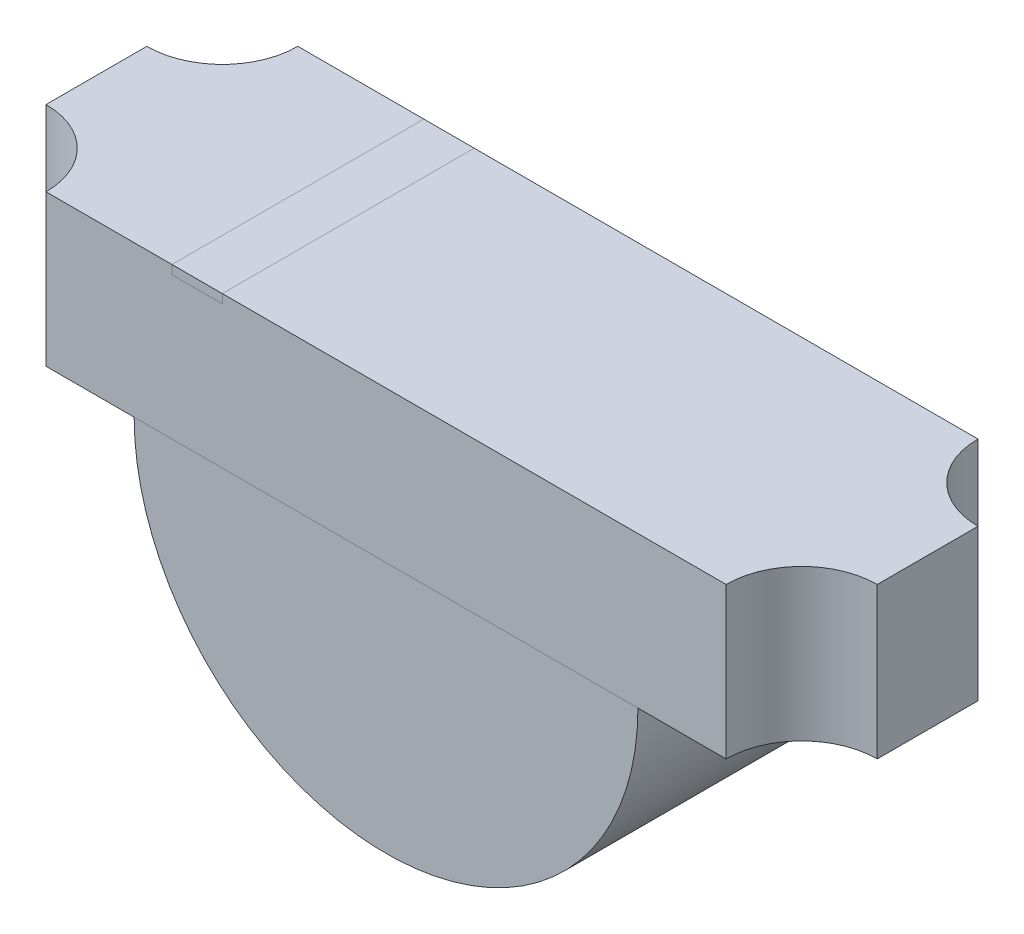
ISO-10303-21;
HEADER;
FILE_DESCRIPTION(('STEP AP214'),'2;1');
FILE_NAME('part.step','',(''),(''),'','','');
FILE_SCHEMA(('AUTOMOTIVE_DESIGN { 1 0 10303 214 1 1 1 1 }'));
ENDSEC;
DATA;
#1=APPLICATION_CONTEXT('core data for automotive mechanical design processes');
#2=APPLICATION_PROTOCOL_DEFINITION('international standard','automotive_design',2000,#1);
#3=PRODUCT_CONTEXT('',#1,'mechanical');
#4=PRODUCT('Part','Part','',(#3));
#5=PRODUCT_RELATED_PRODUCT_CATEGORY('part','',(#4));
#6=PRODUCT_DEFINITION_FORMATION('','',#4);
#7=PRODUCT_DEFINITION_CONTEXT('part definition',#1,'design');
#8=PRODUCT_DEFINITION('design','',#6,#7);
#9=PRODUCT_DEFINITION_SHAPE('','',#8);
#10=(LENGTH_UNIT() NAMED_UNIT(*) SI_UNIT(.MILLI.,.METRE.));
#11=(NAMED_UNIT(*) PLANE_ANGLE_UNIT() SI_UNIT($,.RADIAN.));
#12=(NAMED_UNIT(*) SI_UNIT($,.STERADIAN.) SOLID_ANGLE_UNIT());
#13=UNCERTAINTY_MEASURE_WITH_UNIT(LENGTH_MEASURE(1.E-05),#10,'distance_accuracy_value','');
#14=(GEOMETRIC_REPRESENTATION_CONTEXT(3) GLOBAL_UNCERTAINTY_ASSIGNED_CONTEXT((#13)) GLOBAL_UNIT_ASSIGNED_CONTEXT((#10,
#11,#12)) REPRESENTATION_CONTEXT('',''));
#15=CARTESIAN_POINT('',(0.,0.,0.));
#16=DIRECTION('',(0.,0.,1.));
#17=DIRECTION('',(1.,0.,0.));
#18=AXIS2_PLACEMENT_3D('',#15,#16,#17);
#19=CARTESIAN_POINT('',(-0.85,0.2825,0.5));
#20=DIRECTION('',(1.,0.,0.));
#21=DIRECTION('',(0.,0.,-1.));
#22=AXIS2_PLACEMENT_3D('',#19,#20,#21);
#23=PLANE('',#22);
#24=DIRECTION('',(0.,1.,0.));
#25=VECTOR('',#24,1.);
#26=CARTESIAN_POINT('',(-0.85,0.05,0.));
#27=LINE('',#26,#25);
#28=CARTESIAN_POINT('',(-0.85,0.265,0.));
#29=VERTEX_POINT('',#28);
#30=CARTESIAN_POINT('',(-0.85,0.3,0.));
#31=VERTEX_POINT('',#30);
#32=EDGE_CURVE('P0_E191',#29,#31,#27,.T.);
#33=ORIENTED_EDGE('',*,*,#32,.T.);
#34=DIRECTION('',(0.,0.,-1.));
#35=VECTOR('',#34,1.);
#36=CARTESIAN_POINT('',(-0.85,0.3,0.5));
#37=LINE('',#36,#35);
#38=CARTESIAN_POINT('',(-0.85,0.3,1.));
#39=VERTEX_POINT('',#38);
#40=EDGE_CURVE('P0_E97',#31,#39,#37,.F.);
#41=ORIENTED_EDGE('',*,*,#40,.T.);
#42=DIRECTION('',(0.,1.,0.));
#43=VECTOR('',#42,1.);
#44=CARTESIAN_POINT('',(-0.85,0.05,1.));
#45=LINE('',#44,#43);
#46=CARTESIAN_POINT('',(-0.85,0.265,1.));
#47=VERTEX_POINT('',#46);
#48=EDGE_CURVE('P0_E130',#47,#39,#45,.T.);
#49=ORIENTED_EDGE('',*,*,#48,.F.);
#50=DIRECTION('',(0.,0.,-1.));
#51=VECTOR('',#50,1.);
#52=CARTESIAN_POINT('',(-0.85,0.265,0.5));
#53=LINE('',#52,#51);
#54=EDGE_CURVE('P0_E150',#47,#29,#53,.T.);
#55=ORIENTED_EDGE('',*,*,#54,.T.);
#56=EDGE_LOOP('',(#33,#41,#49,#55));
#57=FACE_BOUND('',#56,.T.);
#58=ADVANCED_FACE('P0_F17',(#57),#23,.T.);
#59=CARTESIAN_POINT('',(-0.05,0.3,0.5));
#60=DIRECTION('',(0.,-1.,0.));
#61=DIRECTION('',(0.,0.,-1.));
#62=AXIS2_PLACEMENT_3D('',#59,#60,#61);
#63=PLANE('',#62);
#64=DIRECTION('',(1.,0.,0.));
#65=VECTOR('',#64,1.);
#66=CARTESIAN_POINT('',(0.,0.3,0.));
#67=LINE('',#66,#65);
#68=CARTESIAN_POINT('',(-1.34999999999999,0.3,1.13403910900508E-12));
#69=VERTEX_POINT('',#68);
#70=EDGE_CURVE('P0_E107',#31,#69,#67,.F.);
#71=ORIENTED_EDGE('',*,*,#70,.T.);
#72=CARTESIAN_POINT('',(-1.65,0.3,0.));
#73=DIRECTION('',(0.,1.,0.));
#74=DIRECTION('',(0.,0.,1.));
#75=AXIS2_PLACEMENT_3D('',#72,#73,#74);
#76=CIRCLE('',#75,0.30000000000001);
#77=CARTESIAN_POINT('',(-1.65,0.3,0.300000000000004));
#78=VERTEX_POINT('',#77);
#79=EDGE_CURVE('P0_E138',#69,#78,#76,.F.);
#80=ORIENTED_EDGE('',*,*,#79,.T.);
#81=DIRECTION('',(0.,0.,-1.));
#82=VECTOR('',#81,1.);
#83=CARTESIAN_POINT('',(-1.65,0.3,0.5));
#84=LINE('',#83,#82);
#85=CARTESIAN_POINT('',(-1.65,0.3,0.7));
#86=VERTEX_POINT('',#85);
#87=EDGE_CURVE('P0_E135',#78,#86,#84,.F.);
#88=ORIENTED_EDGE('',*,*,#87,.T.);
#89=CARTESIAN_POINT('',(-1.65,0.3,1.));
#90=DIRECTION('',(0.,1.,0.));
#91=DIRECTION('',(-1.,0.,0.));
#92=AXIS2_PLACEMENT_3D('',#89,#90,#91);
#93=CIRCLE('',#92,0.3);
#94=CARTESIAN_POINT('',(-1.35,0.3,1.));
#95=VERTEX_POINT('',#94);
#96=EDGE_CURVE('P0_E131',#86,#95,#93,.F.);
#97=ORIENTED_EDGE('',*,*,#96,.T.);
#98=DIRECTION('',(1.,0.,0.));
#99=VECTOR('',#98,1.);
#100=CARTESIAN_POINT('',(0.,0.3,1.));
#101=LINE('',#100,#99);
#102=EDGE_CURVE('P0_E126',#39,#95,#101,.F.);
#103=ORIENTED_EDGE('',*,*,#102,.F.);
#104=ORIENTED_EDGE('',*,*,#40,.F.);
#105=EDGE_LOOP('',(#71,#80,#88,#97,#103,#104));
#106=FACE_BOUND('',#105,.T.);
#107=ADVANCED_FACE('P0_F341',(#106),#63,.F.);
#108=CARTESIAN_POINT('',(0.05,0.3,0.5));
#109=DIRECTION('',(0.,-1.,0.));
#110=DIRECTION('',(0.,0.,-1.));
#111=AXIS2_PLACEMENT_3D('',#108,#109,#110);
#112=PLANE('',#111);
#113=DIRECTION('',(1.,0.,0.));
#114=VECTOR('',#113,1.);
#115=CARTESIAN_POINT('',(0.,0.3,1.));
#116=LINE('',#115,#114);
#117=CARTESIAN_POINT('',(1.34999999999999,0.3,0.999999999998866));
#118=VERTEX_POINT('',#117);
#119=CARTESIAN_POINT('',(-0.65,0.3,1.));
#120=VERTEX_POINT('',#119);
#121=EDGE_CURVE('P0_E125',#118,#120,#116,.F.);
#122=ORIENTED_EDGE('',*,*,#121,.F.);
#123=CARTESIAN_POINT('',(1.65,0.3,1.));
#124=DIRECTION('',(0.,1.,0.));
#125=DIRECTION('',(0.,0.,1.));
#126=AXIS2_PLACEMENT_3D('',#123,#124,#125);
#127=CIRCLE('',#126,0.300000000000011);
#128=CARTESIAN_POINT('',(1.65,0.3,0.699999999999995));
#129=VERTEX_POINT('',#128);
#130=EDGE_CURVE('P0_E152',#129,#118,#127,.T.);
#131=ORIENTED_EDGE('',*,*,#130,.F.);
#132=DIRECTION('',(0.,0.,-1.));
#133=VECTOR('',#132,1.);
#134=CARTESIAN_POINT('',(1.65,0.3,0.5));
#135=LINE('',#134,#133);
#136=CARTESIAN_POINT('',(1.65,0.3,0.299999999999999));
#137=VERTEX_POINT('',#136);
#138=EDGE_CURVE('P0_E95',#137,#129,#135,.F.);
#139=ORIENTED_EDGE('',*,*,#138,.F.);
#140=CARTESIAN_POINT('',(1.65,0.3,0.));
#141=DIRECTION('',(0.,1.,0.));
#142=DIRECTION('',(-1.,0.,0.));
#143=AXIS2_PLACEMENT_3D('',#140,#141,#142);
#144=CIRCLE('',#143,0.3);
#145=CARTESIAN_POINT('',(1.35,0.3,0.));
#146=VERTEX_POINT('',#145);
#147=EDGE_CURVE('P0_E21',#146,#137,#144,.T.);
#148=ORIENTED_EDGE('',*,*,#147,.F.);
#149=DIRECTION('',(1.,0.,0.));
#150=VECTOR('',#149,1.);
#151=CARTESIAN_POINT('',(0.,0.3,0.));
#152=LINE('',#151,#150);
#153=CARTESIAN_POINT('',(-0.65,0.3,0.));
#154=VERTEX_POINT('',#153);
#155=EDGE_CURVE('P0_E93',#146,#154,#152,.F.);
#156=ORIENTED_EDGE('',*,*,#155,.T.);
#157=DIRECTION('',(0.,0.,1.));
#158=VECTOR('',#157,1.);
#159=CARTESIAN_POINT('',(-0.65,0.3,0.5));
#160=LINE('',#159,#158);
#161=EDGE_CURVE('P0_E153',#120,#154,#160,.F.);
#162=ORIENTED_EDGE('',*,*,#161,.F.);
#163=EDGE_LOOP('',(#122,#131,#139,#148,#156,#162));
#164=FACE_BOUND('',#163,.T.);
#165=ADVANCED_FACE('P0_F90',(#164),#112,.F.);
#166=CARTESIAN_POINT('',(-0.65,0.2825,0.5));
#167=DIRECTION('',(-1.,0.,0.));
#168=DIRECTION('',(0.,0.,1.));
#169=AXIS2_PLACEMENT_3D('',#166,#167,#168);
#170=PLANE('',#169);
#171=DIRECTION('',(0.,1.,0.));
#172=VECTOR('',#171,1.);
#173=CARTESIAN_POINT('',(-0.65,0.05,1.));
#174=LINE('',#173,#172);
#175=CARTESIAN_POINT('',(-0.65,0.265,1.));
#176=VERTEX_POINT('',#175);
#177=EDGE_CURVE('P0_E144',#120,#176,#174,.F.);
#178=ORIENTED_EDGE('',*,*,#177,.F.);
#179=ORIENTED_EDGE('',*,*,#161,.T.);
#180=DIRECTION('',(0.,1.,0.));
#181=VECTOR('',#180,1.);
#182=CARTESIAN_POINT('',(-0.65,0.05,0.));
#183=LINE('',#182,#181);
#184=CARTESIAN_POINT('',(-0.65,0.265,0.));
#185=VERTEX_POINT('',#184);
#186=EDGE_CURVE('P0_E106',#154,#185,#183,.F.);
#187=ORIENTED_EDGE('',*,*,#186,.T.);
#188=DIRECTION('',(0.,0.,-1.));
#189=VECTOR('',#188,1.);
#190=CARTESIAN_POINT('',(-0.65,0.265,0.5));
#191=LINE('',#190,#189);
#192=EDGE_CURVE('P0_E147',#185,#176,#191,.F.);
#193=ORIENTED_EDGE('',*,*,#192,.T.);
#194=EDGE_LOOP('',(#178,#179,#187,#193));
#195=FACE_BOUND('',#194,.T.);
#196=ADVANCED_FACE('P0_F322',(#195),#170,.T.);
#197=CARTESIAN_POINT('',(-0.75,0.265,0.5));
#198=DIRECTION('',(0.,-1.,0.));
#199=DIRECTION('',(0.,0.,-1.));
#200=AXIS2_PLACEMENT_3D('',#197,#198,#199);
#201=PLANE('',#200);
#202=ORIENTED_EDGE('',*,*,#192,.F.);
#203=DIRECTION('',(1.,0.,0.));
#204=VECTOR('',#203,1.);
#205=CARTESIAN_POINT('',(0.,0.265,0.));
#206=LINE('',#205,#204);
#207=EDGE_CURVE('P0_E188',#185,#29,#206,.F.);
#208=ORIENTED_EDGE('',*,*,#207,.T.);
#209=ORIENTED_EDGE('',*,*,#54,.F.);
#210=DIRECTION('',(1.,0.,0.));
#211=VECTOR('',#210,1.);
#212=CARTESIAN_POINT('',(0.,0.265,1.));
#213=LINE('',#212,#211);
#214=EDGE_CURVE('P0_E122',#176,#47,#213,.F.);
#215=ORIENTED_EDGE('',*,*,#214,.F.);
#216=EDGE_LOOP('',(#202,#208,#209,#215));
#217=FACE_BOUND('',#216,.T.);
#218=ADVANCED_FACE('P0_F313',(#217),#201,.F.);
#219=CARTESIAN_POINT('',(0.,0.05,0.));
#220=DIRECTION('',(0.,0.,1.));
#221=DIRECTION('',(1.,0.,0.));
#222=AXIS2_PLACEMENT_3D('',#219,#220,#221);
#223=PLANE('',#222);
#224=ORIENTED_EDGE('',*,*,#207,.F.);
#225=ORIENTED_EDGE('',*,*,#186,.F.);
#226=ORIENTED_EDGE('',*,*,#155,.F.);
#227=DIRECTION('',(0.,1.,0.));
#228=VECTOR('',#227,1.);
#229=CARTESIAN_POINT('',(1.35,0.374976204826,0.));
#230=LINE('',#229,#228);
#231=CARTESIAN_POINT('',(1.35,-0.3,0.));
#232=VERTEX_POINT('',#231);
#233=EDGE_CURVE('P0_E104',#146,#232,#230,.F.);
#234=ORIENTED_EDGE('',*,*,#233,.T.);
#235=DIRECTION('',(1.,0.,0.));
#236=VECTOR('',#235,1.);
#237=CARTESIAN_POINT('',(0.,-0.3,0.));
#238=LINE('',#237,#236);
#239=CARTESIAN_POINT('',(-1.34999999999999,-0.3,1.13403910900508E-12));
#240=VERTEX_POINT('',#239);
#241=EDGE_CURVE('P0_E112',#232,#240,#238,.F.);
#242=ORIENTED_EDGE('',*,*,#241,.T.);
#243=DIRECTION('',(0.,1.,0.));
#244=VECTOR('',#243,1.);
#245=CARTESIAN_POINT('',(-1.35,0.,2.26807821801017E-12));
#246=LINE('',#245,#244);
#247=EDGE_CURVE('P0_E136',#240,#69,#246,.T.);
#248=ORIENTED_EDGE('',*,*,#247,.T.);
#249=ORIENTED_EDGE('',*,*,#70,.F.);
#250=ORIENTED_EDGE('',*,*,#32,.F.);
#251=EDGE_LOOP('',(#224,#225,#226,#234,#242,#248,#249,#250));
#252=FACE_BOUND('',#251,.T.);
#253=ADVANCED_FACE('P0_F102',(#252),#223,.F.);
#254=CARTESIAN_POINT('',(-1.65,-0.3,0.));
#255=DIRECTION('',(0.,1.,0.));
#256=DIRECTION('',(0.,0.,1.));
#257=AXIS2_PLACEMENT_3D('',#254,#255,#256);
#258=CYLINDRICAL_SURFACE('',#257,0.30000000000001);
#259=CARTESIAN_POINT('',(-1.65,-0.3,0.));
#260=DIRECTION('',(0.,1.,0.));
#261=DIRECTION('',(0.,0.,1.));
#262=AXIS2_PLACEMENT_3D('',#259,#260,#261);
#263=CIRCLE('',#262,0.30000000000001);
#264=CARTESIAN_POINT('',(-1.65,-0.3,0.300000000000004));
#265=VERTEX_POINT('',#264);
#266=EDGE_CURVE('P0_E208',#240,#265,#263,.F.);
#267=ORIENTED_EDGE('',*,*,#266,.T.);
#268=DIRECTION('',(0.,1.,0.));
#269=VECTOR('',#268,1.);
#270=CARTESIAN_POINT('',(-1.65,-0.05,0.3));
#271=LINE('',#270,#269);
#272=EDGE_CURVE('P0_E132',#265,#78,#271,.T.);
#273=ORIENTED_EDGE('',*,*,#272,.T.);
#274=ORIENTED_EDGE('',*,*,#79,.F.);
#275=ORIENTED_EDGE('',*,*,#247,.F.);
#276=EDGE_LOOP('',(#267,#273,#274,#275));
#277=FACE_BOUND('',#276,.T.);
#278=ADVANCED_FACE('P0_F234',(#277),#258,.F.);
#279=CARTESIAN_POINT('',(-1.65,-0.05,0.5));
#280=DIRECTION('',(1.,0.,0.));
#281=DIRECTION('',(0.,0.,-1.));
#282=AXIS2_PLACEMENT_3D('',#279,#280,#281);
#283=PLANE('',#282);
#284=DIRECTION('',(0.,0.,1.));
#285=VECTOR('',#284,1.);
#286=CARTESIAN_POINT('',(-1.65,-0.3,0.5));
#287=LINE('',#286,#285);
#288=CARTESIAN_POINT('',(-1.65,-0.3,0.7));
#289=VERTEX_POINT('',#288);
#290=EDGE_CURVE('P0_E207',#265,#289,#287,.T.);
#291=ORIENTED_EDGE('',*,*,#290,.T.);
#292=DIRECTION('',(0.,1.,0.));
#293=VECTOR('',#292,1.);
#294=CARTESIAN_POINT('',(-1.65,0.374976204826,0.7));
#295=LINE('',#294,#293);
#296=EDGE_CURVE('P0_E127',#289,#86,#295,.T.);
#297=ORIENTED_EDGE('',*,*,#296,.T.);
#298=ORIENTED_EDGE('',*,*,#87,.F.);
#299=ORIENTED_EDGE('',*,*,#272,.F.);
#300=EDGE_LOOP('',(#291,#297,#298,#299));
#301=FACE_BOUND('',#300,.T.);
#302=ADVANCED_FACE('P0_F229',(#301),#283,.F.);
#303=CARTESIAN_POINT('',(-1.65,0.374976204826,1.));
#304=DIRECTION('',(0.,1.,0.));
#305=DIRECTION('',(-1.,0.,0.));
#306=AXIS2_PLACEMENT_3D('',#303,#304,#305);
#307=CYLINDRICAL_SURFACE('',#306,0.3);
#308=CARTESIAN_POINT('',(-1.65,-0.3,1.));
#309=DIRECTION('',(0.,1.,0.));
#310=DIRECTION('',(-1.,0.,0.));
#311=AXIS2_PLACEMENT_3D('',#308,#309,#310);
#312=CIRCLE('',#311,0.3);
#313=CARTESIAN_POINT('',(-1.35,-0.3,1.));
#314=VERTEX_POINT('',#313);
#315=EDGE_CURVE('P0_E204',#289,#314,#312,.F.);
#316=ORIENTED_EDGE('',*,*,#315,.T.);
#317=DIRECTION('',(0.,1.,0.));
#318=VECTOR('',#317,1.);
#319=CARTESIAN_POINT('',(-1.35,0.05,1.));
#320=LINE('',#319,#318);
#321=EDGE_CURVE('P0_E123',#95,#314,#320,.F.);
#322=ORIENTED_EDGE('',*,*,#321,.F.);
#323=ORIENTED_EDGE('',*,*,#96,.F.);
#324=ORIENTED_EDGE('',*,*,#296,.F.);
#325=EDGE_LOOP('',(#316,#322,#323,#324));
#326=FACE_BOUND('',#325,.T.);
#327=ADVANCED_FACE('P0_F281',(#326),#307,.F.);
#328=CARTESIAN_POINT('',(0.,0.05,1.));
#329=DIRECTION('',(0.,0.,1.));
#330=DIRECTION('',(1.,0.,0.));
#331=AXIS2_PLACEMENT_3D('',#328,#329,#330);
#332=PLANE('',#331);
#333=ORIENTED_EDGE('',*,*,#177,.T.);
#334=ORIENTED_EDGE('',*,*,#214,.T.);
#335=ORIENTED_EDGE('',*,*,#48,.T.);
#336=ORIENTED_EDGE('',*,*,#102,.T.);
#337=ORIENTED_EDGE('',*,*,#321,.T.);
#338=DIRECTION('',(1.,0.,0.));
#339=VECTOR('',#338,1.);
#340=CARTESIAN_POINT('',(0.,-0.3,1.));
#341=LINE('',#340,#339);
#342=CARTESIAN_POINT('',(1.34999999999999,-0.3,0.999999999998866));
#343=VERTEX_POINT('',#342);
#344=EDGE_CURVE('P0_E203',#314,#343,#341,.T.);
#345=ORIENTED_EDGE('',*,*,#344,.T.);
#346=DIRECTION('',(0.,1.,0.));
#347=VECTOR('',#346,1.);
#348=CARTESIAN_POINT('',(1.35,0.,0.999999999997732));
#349=LINE('',#348,#347);
#350=EDGE_CURVE('P0_E115',#343,#118,#349,.T.);
#351=ORIENTED_EDGE('',*,*,#350,.T.);
#352=ORIENTED_EDGE('',*,*,#121,.T.);
#353=EDGE_LOOP('',(#333,#334,#335,#336,#337,#345,#351,#352));
#354=FACE_BOUND('',#353,.T.);
#355=ADVANCED_FACE('P0_F219',(#354),#332,.T.);
#356=CARTESIAN_POINT('',(1.65,-0.3,1.));
#357=DIRECTION('',(0.,1.,0.));
#358=DIRECTION('',(0.,0.,1.));
#359=AXIS2_PLACEMENT_3D('',#356,#357,#358);
#360=CYLINDRICAL_SURFACE('',#359,0.300000000000011);
#361=CARTESIAN_POINT('',(1.65,-0.3,1.));
#362=DIRECTION('',(0.,1.,0.));
#363=DIRECTION('',(0.,0.,1.));
#364=AXIS2_PLACEMENT_3D('',#361,#362,#363);
#365=CIRCLE('',#364,0.300000000000011);
#366=CARTESIAN_POINT('',(1.65,-0.3,0.699999999999995));
#367=VERTEX_POINT('',#366);
#368=EDGE_CURVE('P0_E200',#343,#367,#365,.F.);
#369=ORIENTED_EDGE('',*,*,#368,.T.);
#370=DIRECTION('',(0.,1.,0.));
#371=VECTOR('',#370,1.);
#372=CARTESIAN_POINT('',(1.65,-0.05,0.7));
#373=LINE('',#372,#371);
#374=EDGE_CURVE('P0_E110',#367,#129,#373,.T.);
#375=ORIENTED_EDGE('',*,*,#374,.T.);
#376=ORIENTED_EDGE('',*,*,#130,.T.);
#377=ORIENTED_EDGE('',*,*,#350,.F.);
#378=EDGE_LOOP('',(#369,#375,#376,#377));
#379=FACE_BOUND('',#378,.T.);
#380=ADVANCED_FACE('P0_F19',(#379),#360,.F.);
#381=CARTESIAN_POINT('',(1.65,-0.05,0.5));
#382=DIRECTION('',(-1.,0.,0.));
#383=DIRECTION('',(0.,0.,1.));
#384=AXIS2_PLACEMENT_3D('',#381,#382,#383);
#385=PLANE('',#384);
#386=DIRECTION('',(0.,0.,1.));
#387=VECTOR('',#386,1.);
#388=CARTESIAN_POINT('',(1.65,-0.3,0.5));
#389=LINE('',#388,#387);
#390=CARTESIAN_POINT('',(1.65,-0.3,0.299999999999999));
#391=VERTEX_POINT('',#390);
#392=EDGE_CURVE('P0_E27',#367,#391,#389,.F.);
#393=ORIENTED_EDGE('',*,*,#392,.T.);
#394=DIRECTION('',(0.,1.,0.));
#395=VECTOR('',#394,1.);
#396=CARTESIAN_POINT('',(1.65,0.374976204826,0.299999999999999));
#397=LINE('',#396,#395);
#398=EDGE_CURVE('P0_E35',#391,#137,#397,.T.);
#399=ORIENTED_EDGE('',*,*,#398,.T.);
#400=ORIENTED_EDGE('',*,*,#138,.T.);
#401=ORIENTED_EDGE('',*,*,#374,.F.);
#402=EDGE_LOOP('',(#393,#399,#400,#401));
#403=FACE_BOUND('',#402,.T.);
#404=ADVANCED_FACE('P0_F239',(#403),#385,.F.);
#405=CARTESIAN_POINT('',(1.65,0.374976204826,0.));
#406=DIRECTION('',(0.,1.,0.));
#407=DIRECTION('',(-1.,0.,0.));
#408=AXIS2_PLACEMENT_3D('',#405,#406,#407);
#409=CYLINDRICAL_SURFACE('',#408,0.3);
#410=CARTESIAN_POINT('',(1.65,-0.3,0.));
#411=DIRECTION('',(0.,1.,0.));
#412=DIRECTION('',(-1.,0.,0.));
#413=AXIS2_PLACEMENT_3D('',#410,#411,#412);
#414=CIRCLE('',#413,0.3);
#415=EDGE_CURVE('P0_E11',#391,#232,#414,.F.);
#416=ORIENTED_EDGE('',*,*,#415,.T.);
#417=ORIENTED_EDGE('',*,*,#233,.F.);
#418=ORIENTED_EDGE('',*,*,#147,.T.);
#419=ORIENTED_EDGE('',*,*,#398,.F.);
#420=EDGE_LOOP('',(#416,#417,#418,#419));
#421=FACE_BOUND('',#420,.T.);
#422=ADVANCED_FACE('P0_F109',(#421),#409,.F.);
#423=CARTESIAN_POINT('',(0.,-0.3,0.5));
#424=DIRECTION('',(0.,1.,0.));
#425=DIRECTION('',(0.,0.,1.));
#426=AXIS2_PLACEMENT_3D('',#423,#424,#425);
#427=PLANE('',#426);
#428=ORIENTED_EDGE('',*,*,#392,.F.);
#429=ORIENTED_EDGE('',*,*,#368,.F.);
#430=ORIENTED_EDGE('',*,*,#344,.F.);
#431=ORIENTED_EDGE('',*,*,#315,.F.);
#432=ORIENTED_EDGE('',*,*,#290,.F.);
#433=ORIENTED_EDGE('',*,*,#266,.F.);
#434=ORIENTED_EDGE('',*,*,#241,.F.);
#435=ORIENTED_EDGE('',*,*,#415,.F.);
#436=EDGE_LOOP('',(#428,#429,#430,#431,#432,#433,#434,#435));
#437=FACE_BOUND('',#436,.T.);
#438=ADVANCED_FACE('P0_F232',(#437),#427,.F.);
#439=CLOSED_SHELL('',(#58,#107,#165,#196,#218,#253,#278,#302,#327,#355,#380,#404,#422,#438));
#440=MANIFOLD_SOLID_BREP('P0_B1',#439);
#441=CARTESIAN_POINT('',(-0.75,0.3,0.5));
#442=DIRECTION('',(0.,-1.,0.));
#443=DIRECTION('',(0.,0.,-1.));
#444=AXIS2_PLACEMENT_3D('',#441,#442,#443);
#445=PLANE('',#444);
#446=DIRECTION('',(0.,0.,1.));
#447=VECTOR('',#446,1.);
#448=CARTESIAN_POINT('',(-0.65,0.3,0.5));
#449=LINE('',#448,#447);
#450=CARTESIAN_POINT('',(-0.65,0.3,1.));
#451=VERTEX_POINT('',#450);
#452=CARTESIAN_POINT('',(-0.65,0.3,0.));
#453=VERTEX_POINT('',#452);
#454=EDGE_CURVE('P1_E80',#451,#453,#449,.F.);
#455=ORIENTED_EDGE('',*,*,#454,.T.);
#456=DIRECTION('',(1.,0.,0.));
#457=VECTOR('',#456,1.);
#458=CARTESIAN_POINT('',(-0.75,0.3,0.));
#459=LINE('',#458,#457);
#460=CARTESIAN_POINT('',(-0.85,0.3,0.));
#461=VERTEX_POINT('',#460);
#462=EDGE_CURVE('P1_E55',#453,#461,#459,.F.);
#463=ORIENTED_EDGE('',*,*,#462,.T.);
#464=DIRECTION('',(0.,0.,-1.));
#465=VECTOR('',#464,1.);
#466=CARTESIAN_POINT('',(-0.85,0.3,0.5));
#467=LINE('',#466,#465);
#468=CARTESIAN_POINT('',(-0.85,0.3,1.));
#469=VERTEX_POINT('',#468);
#470=EDGE_CURVE('P1_E57',#461,#469,#467,.F.);
#471=ORIENTED_EDGE('',*,*,#470,.T.);
#472=DIRECTION('',(-1.,0.,0.));
#473=VECTOR('',#472,1.);
#474=CARTESIAN_POINT('',(-0.75,0.3,1.));
#475=LINE('',#474,#473);
#476=EDGE_CURVE('P1_E20',#469,#451,#475,.F.);
#477=ORIENTED_EDGE('',*,*,#476,.T.);
#478=EDGE_LOOP('',(#455,#463,#471,#477));
#479=FACE_BOUND('',#478,.T.);
#480=ADVANCED_FACE('P1_F17',(#479),#445,.F.);
#481=CARTESIAN_POINT('',(-0.75,0.2825,1.));
#482=DIRECTION('',(0.,0.,-1.));
#483=DIRECTION('',(-1.,0.,0.));
#484=AXIS2_PLACEMENT_3D('',#481,#482,#483);
#485=PLANE('',#484);
#486=ORIENTED_EDGE('',*,*,#476,.F.);
#487=DIRECTION('',(0.,1.,0.));
#488=VECTOR('',#487,1.);
#489=CARTESIAN_POINT('',(-0.85,0.2825,1.));
#490=LINE('',#489,#488);
#491=CARTESIAN_POINT('',(-0.85,0.265,1.));
#492=VERTEX_POINT('',#491);
#493=EDGE_CURVE('P1_E63',#469,#492,#490,.F.);
#494=ORIENTED_EDGE('',*,*,#493,.T.);
#495=DIRECTION('',(1.,0.,0.));
#496=VECTOR('',#495,1.);
#497=CARTESIAN_POINT('',(-0.75,0.265,1.));
#498=LINE('',#497,#496);
#499=CARTESIAN_POINT('',(-0.65,0.265,1.));
#500=VERTEX_POINT('',#499);
#501=EDGE_CURVE('P1_E83',#500,#492,#498,.F.);
#502=ORIENTED_EDGE('',*,*,#501,.F.);
#503=DIRECTION('',(0.,1.,0.));
#504=VECTOR('',#503,1.);
#505=CARTESIAN_POINT('',(-0.65,0.2825,1.));
#506=LINE('',#505,#504);
#507=EDGE_CURVE('P1_E68',#500,#451,#506,.T.);
#508=ORIENTED_EDGE('',*,*,#507,.T.);
#509=EDGE_LOOP('',(#486,#494,#502,#508));
#510=FACE_BOUND('',#509,.T.);
#511=ADVANCED_FACE('P1_F65',(#510),#485,.F.);
#512=CARTESIAN_POINT('',(-0.85,0.2825,0.5));
#513=DIRECTION('',(1.,0.,0.));
#514=DIRECTION('',(0.,0.,-1.));
#515=AXIS2_PLACEMENT_3D('',#512,#513,#514);
#516=PLANE('',#515);
#517=ORIENTED_EDGE('',*,*,#470,.F.);
#518=DIRECTION('',(0.,1.,0.));
#519=VECTOR('',#518,1.);
#520=CARTESIAN_POINT('',(-0.85,0.2825,0.));
#521=LINE('',#520,#519);
#522=CARTESIAN_POINT('',(-0.85,0.265,0.));
#523=VERTEX_POINT('',#522);
#524=EDGE_CURVE('P1_E75',#461,#523,#521,.F.);
#525=ORIENTED_EDGE('',*,*,#524,.T.);
#526=DIRECTION('',(0.,0.,-1.));
#527=VECTOR('',#526,1.);
#528=CARTESIAN_POINT('',(-0.85,0.265,0.5));
#529=LINE('',#528,#527);
#530=EDGE_CURVE('P1_E72',#492,#523,#529,.T.);
#531=ORIENTED_EDGE('',*,*,#530,.F.);
#532=ORIENTED_EDGE('',*,*,#493,.F.);
#533=EDGE_LOOP('',(#517,#525,#531,#532));
#534=FACE_BOUND('',#533,.T.);
#535=ADVANCED_FACE('P1_F70',(#534),#516,.F.);
#536=CARTESIAN_POINT('',(-0.75,0.2825,0.));
#537=DIRECTION('',(0.,0.,1.));
#538=DIRECTION('',(1.,0.,0.));
#539=AXIS2_PLACEMENT_3D('',#536,#537,#538);
#540=PLANE('',#539);
#541=ORIENTED_EDGE('',*,*,#462,.F.);
#542=DIRECTION('',(0.,1.,0.));
#543=VECTOR('',#542,1.);
#544=CARTESIAN_POINT('',(-0.65,0.2825,0.));
#545=LINE('',#544,#543);
#546=CARTESIAN_POINT('',(-0.65,0.265,0.));
#547=VERTEX_POINT('',#546);
#548=EDGE_CURVE('P1_E35',#453,#547,#545,.F.);
#549=ORIENTED_EDGE('',*,*,#548,.T.);
#550=DIRECTION('',(1.,0.,0.));
#551=VECTOR('',#550,1.);
#552=CARTESIAN_POINT('',(-0.75,0.265,0.));
#553=LINE('',#552,#551);
#554=EDGE_CURVE('P1_E26',#523,#547,#553,.T.);
#555=ORIENTED_EDGE('',*,*,#554,.F.);
#556=ORIENTED_EDGE('',*,*,#524,.F.);
#557=EDGE_LOOP('',(#541,#549,#555,#556));
#558=FACE_BOUND('',#557,.T.);
#559=ADVANCED_FACE('P1_F89',(#558),#540,.F.);
#560=CARTESIAN_POINT('',(-0.65,0.2825,0.5));
#561=DIRECTION('',(-1.,0.,0.));
#562=DIRECTION('',(0.,0.,1.));
#563=AXIS2_PLACEMENT_3D('',#560,#561,#562);
#564=PLANE('',#563);
#565=ORIENTED_EDGE('',*,*,#454,.F.);
#566=ORIENTED_EDGE('',*,*,#507,.F.);
#567=DIRECTION('',(0.,0.,-1.));
#568=VECTOR('',#567,1.);
#569=CARTESIAN_POINT('',(-0.65,0.265,0.5));
#570=LINE('',#569,#568);
#571=EDGE_CURVE('P1_E11',#547,#500,#570,.F.);
#572=ORIENTED_EDGE('',*,*,#571,.F.);
#573=ORIENTED_EDGE('',*,*,#548,.F.);
#574=EDGE_LOOP('',(#565,#566,#572,#573));
#575=FACE_BOUND('',#574,.T.);
#576=ADVANCED_FACE('P1_F91',(#575),#564,.F.);
#577=CARTESIAN_POINT('',(-0.75,0.265,0.5));
#578=DIRECTION('',(0.,-1.,0.));
#579=DIRECTION('',(0.,0.,-1.));
#580=AXIS2_PLACEMENT_3D('',#577,#578,#579);
#581=PLANE('',#580);
#582=ORIENTED_EDGE('',*,*,#554,.T.);
#583=ORIENTED_EDGE('',*,*,#571,.T.);
#584=ORIENTED_EDGE('',*,*,#501,.T.);
#585=ORIENTED_EDGE('',*,*,#530,.T.);
#586=EDGE_LOOP('',(#582,#583,#584,#585));
#587=FACE_BOUND('',#586,.T.);
#588=ADVANCED_FACE('P1_F88',(#587),#581,.T.);
#589=CLOSED_SHELL('',(#480,#511,#535,#559,#576,#588));
#590=MANIFOLD_SOLID_BREP('P1_B1',#589);
#591=CARTESIAN_POINT('',(1.,-0.3,1.));
#592=DIRECTION('',(0.,1.,0.));
#593=DIRECTION('',(0.,0.,-1.));
#594=AXIS2_PLACEMENT_3D('',#591,#592,#593);
#595=PLANE('',#594);
#596=DIRECTION('',(1.,0.,0.));
#597=VECTOR('',#596,1.);
#598=CARTESIAN_POINT('',(0.,-0.3,1.));
#599=LINE('',#598,#597);
#600=CARTESIAN_POINT('',(1.,-0.3,1.));
#601=VERTEX_POINT('',#600);
#602=CARTESIAN_POINT('',(-1.,-0.3,1.));
#603=VERTEX_POINT('',#602);
#604=EDGE_CURVE('P2_E49',#601,#603,#599,.F.);
#605=ORIENTED_EDGE('',*,*,#604,.F.);
#606=DIRECTION('',(0.,0.,-1.));
#607=VECTOR('',#606,1.);
#608=CARTESIAN_POINT('',(1.,-0.3,0.5));
#609=LINE('',#608,#607);
#610=CARTESIAN_POINT('',(1.,-0.3,0.));
#611=VERTEX_POINT('',#610);
#612=EDGE_CURVE('P2_E31',#601,#611,#609,.T.);
#613=ORIENTED_EDGE('',*,*,#612,.T.);
#614=DIRECTION('',(-1.,0.,0.));
#615=VECTOR('',#614,1.);
#616=CARTESIAN_POINT('',(0.,-0.3,0.));
#617=LINE('',#616,#615);
#618=CARTESIAN_POINT('',(-1.,-0.3,0.));
#619=VERTEX_POINT('',#618);
#620=EDGE_CURVE('P2_E47',#619,#611,#617,.F.);
#621=ORIENTED_EDGE('',*,*,#620,.F.);
#622=DIRECTION('',(0.,0.,1.));
#623=VECTOR('',#622,1.);
#624=CARTESIAN_POINT('',(-1.,-0.3,0.5));
#625=LINE('',#624,#623);
#626=EDGE_CURVE('P2_E38',#619,#603,#625,.T.);
#627=ORIENTED_EDGE('',*,*,#626,.T.);
#628=EDGE_LOOP('',(#605,#613,#621,#627));
#629=FACE_BOUND('',#628,.T.);
#630=ADVANCED_FACE('P2_F17',(#629),#595,.T.);
#631=CARTESIAN_POINT('',(0.,-0.3,0.));
#632=DIRECTION('',(0.,0.,-1.));
#633=DIRECTION('',(-1.,0.,0.));
#634=AXIS2_PLACEMENT_3D('',#631,#632,#633);
#635=PLANE('',#634);
#636=ORIENTED_EDGE('',*,*,#620,.T.);
#637=CARTESIAN_POINT('',(0.,-0.3,0.));
#638=DIRECTION('',(0.,0.,1.));
#639=DIRECTION('',(1.,0.,0.));
#640=AXIS2_PLACEMENT_3D('',#637,#638,#639);
#641=CIRCLE('',#640,1.);
#642=EDGE_CURVE('P2_E20',#619,#611,#641,.T.);
#643=ORIENTED_EDGE('',*,*,#642,.F.);
#644=EDGE_LOOP('',(#636,#643));
#645=FACE_BOUND('',#644,.T.);
#646=ADVANCED_FACE('P2_F51',(#645),#635,.T.);
#647=CARTESIAN_POINT('',(0.,-0.3,1.));
#648=DIRECTION('',(0.,0.,1.));
#649=DIRECTION('',(1.,0.,0.));
#650=AXIS2_PLACEMENT_3D('',#647,#648,#649);
#651=PLANE('',#650);
#652=ORIENTED_EDGE('',*,*,#604,.T.);
#653=CARTESIAN_POINT('',(0.,-0.3,1.));
#654=DIRECTION('',(0.,0.,1.));
#655=DIRECTION('',(1.,0.,0.));
#656=AXIS2_PLACEMENT_3D('',#653,#654,#655);
#657=CIRCLE('',#656,1.);
#658=EDGE_CURVE('P2_E11',#601,#603,#657,.F.);
#659=ORIENTED_EDGE('',*,*,#658,.F.);
#660=EDGE_LOOP('',(#652,#659));
#661=FACE_BOUND('',#660,.T.);
#662=ADVANCED_FACE('P2_F55',(#661),#651,.T.);
#663=CARTESIAN_POINT('',(0.,-0.3,0.5));
#664=DIRECTION('',(0.,0.,1.));
#665=DIRECTION('',(1.,0.,0.));
#666=AXIS2_PLACEMENT_3D('',#663,#664,#665);
#667=CYLINDRICAL_SURFACE('',#666,1.);
#668=ORIENTED_EDGE('',*,*,#612,.F.);
#669=ORIENTED_EDGE('',*,*,#658,.T.);
#670=ORIENTED_EDGE('',*,*,#626,.F.);
#671=ORIENTED_EDGE('',*,*,#642,.T.);
#672=EDGE_LOOP('',(#668,#669,#670,#671));
#673=FACE_BOUND('',#672,.T.);
#674=ADVANCED_FACE('P2_F40',(#673),#667,.T.);
#675=CLOSED_SHELL('',(#630,#646,#662,#674));
#676=MANIFOLD_SOLID_BREP('P2_B1',#675);
#677=ADVANCED_BREP_SHAPE_REPRESENTATION('',(#18,#440,#590,#676),#14);
#678=SHAPE_DEFINITION_REPRESENTATION(#9,#677);
ENDSEC;
END-ISO-10303-21;
